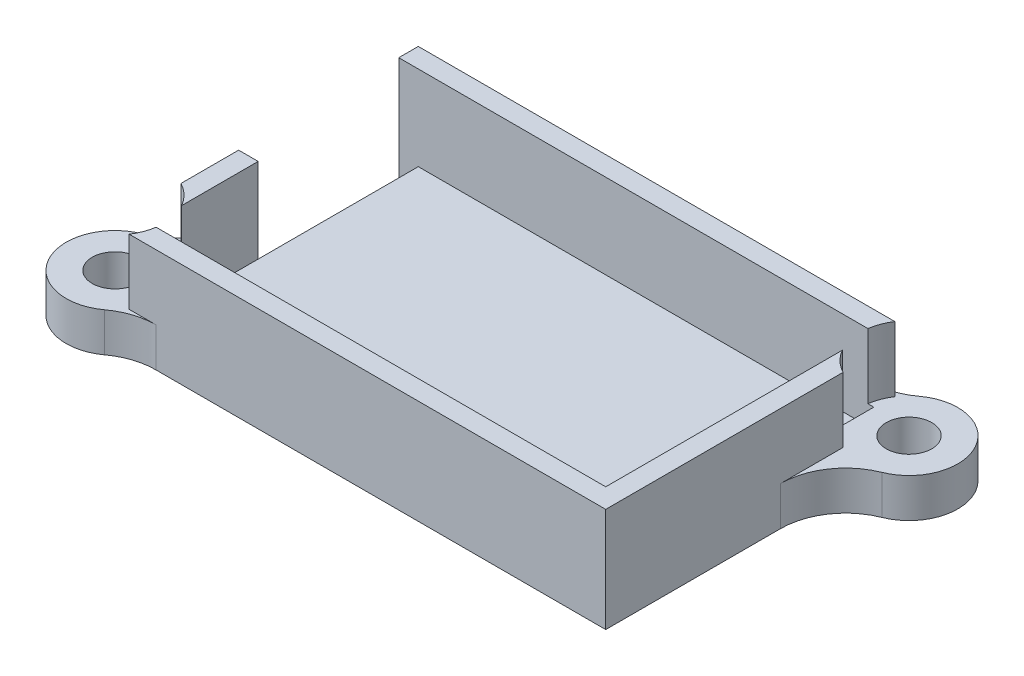
ISO-10303-21;
HEADER;
FILE_DESCRIPTION(('STEP AP214'),'2;1');
FILE_NAME('part.step','',(''),(''),'','','');
FILE_SCHEMA(('AUTOMOTIVE_DESIGN { 1 0 10303 214 1 1 1 1 }'));
ENDSEC;
DATA;
#1=APPLICATION_CONTEXT('core data for automotive mechanical design processes');
#2=APPLICATION_PROTOCOL_DEFINITION('international standard','automotive_design',2000,#1);
#3=PRODUCT_CONTEXT('',#1,'mechanical');
#4=PRODUCT('Part','Part','',(#3));
#5=PRODUCT_RELATED_PRODUCT_CATEGORY('part','',(#4));
#6=PRODUCT_DEFINITION_FORMATION('','',#4);
#7=PRODUCT_DEFINITION_CONTEXT('part definition',#1,'design');
#8=PRODUCT_DEFINITION('design','',#6,#7);
#9=PRODUCT_DEFINITION_SHAPE('','',#8);
#10=(LENGTH_UNIT() NAMED_UNIT(*) SI_UNIT(.MILLI.,.METRE.));
#11=(NAMED_UNIT(*) PLANE_ANGLE_UNIT() SI_UNIT($,.RADIAN.));
#12=(NAMED_UNIT(*) SI_UNIT($,.STERADIAN.) SOLID_ANGLE_UNIT());
#13=UNCERTAINTY_MEASURE_WITH_UNIT(LENGTH_MEASURE(1.E-05),#10,'distance_accuracy_value','');
#14=(GEOMETRIC_REPRESENTATION_CONTEXT(3) GLOBAL_UNCERTAINTY_ASSIGNED_CONTEXT((#13)) GLOBAL_UNIT_ASSIGNED_CONTEXT((#10,
#11,#12)) REPRESENTATION_CONTEXT('',''));
#15=CARTESIAN_POINT('',(0.,0.,0.));
#16=DIRECTION('',(0.,0.,1.));
#17=DIRECTION('',(1.,0.,0.));
#18=AXIS2_PLACEMENT_3D('',#15,#16,#17);
#19=CARTESIAN_POINT('',(-20.75,8.,9.75000000000024));
#20=DIRECTION('',(0.,-1.,0.));
#21=DIRECTION('',(0.,0.,-1.));
#22=AXIS2_PLACEMENT_3D('',#19,#20,#21);
#23=CYLINDRICAL_SURFACE('',#22,3.75);
#24=CARTESIAN_POINT('',(-20.75,3.,9.75000000000024));
#25=DIRECTION('',(0.,1.,0.));
#26=DIRECTION('',(0.,0.,1.));
#27=AXIS2_PLACEMENT_3D('',#24,#25,#26);
#28=CIRCLE('',#27,3.75);
#29=CARTESIAN_POINT('',(-22.1366660575432,3.,6.2657989086656));
#30=VERTEX_POINT('',#29);
#31=CARTESIAN_POINT('',(-18.5288585394541,3.,12.7714285714287));
#32=VERTEX_POINT('',#31);
#33=EDGE_CURVE('E376',#30,#32,#28,.T.);
#34=ORIENTED_EDGE('',*,*,#33,.F.);
#35=DIRECTION('',(0.,-1.,0.));
#36=VECTOR('',#35,1.);
#37=CARTESIAN_POINT('',(-22.1366660575432,8.,6.2657989086656));
#38=LINE('',#37,#36);
#39=CARTESIAN_POINT('',(-22.1366660575432,0.,6.2657989086656));
#40=VERTEX_POINT('',#39);
#41=EDGE_CURVE('E340',#30,#40,#38,.T.);
#42=ORIENTED_EDGE('',*,*,#41,.T.);
#43=CARTESIAN_POINT('',(-20.75,0.,9.75000000000024));
#44=DIRECTION('',(0.,1.,0.));
#45=DIRECTION('',(0.,0.,1.));
#46=AXIS2_PLACEMENT_3D('',#43,#44,#45);
#47=CIRCLE('',#46,3.75);
#48=CARTESIAN_POINT('',(-18.5288585394541,0.,12.7714285714287));
#49=VERTEX_POINT('',#48);
#50=EDGE_CURVE('E218',#40,#49,#47,.T.);
#51=ORIENTED_EDGE('',*,*,#50,.T.);
#52=DIRECTION('',(0.,-1.,0.));
#53=VECTOR('',#52,1.);
#54=CARTESIAN_POINT('',(-18.5288585394541,8.,12.7714285714287));
#55=LINE('',#54,#53);
#56=EDGE_CURVE('E338',#49,#32,#55,.F.);
#57=ORIENTED_EDGE('',*,*,#56,.T.);
#58=EDGE_LOOP('',(#34,#42,#51,#57));
#59=FACE_BOUND('',#58,.T.);
#60=ADVANCED_FACE('F41',(#59),#23,.T.);
#61=CARTESIAN_POINT('',(20.75,8.,-9.74999999999976));
#62=DIRECTION('',(0.,-1.,0.));
#63=DIRECTION('',(0.,0.,-1.));
#64=AXIS2_PLACEMENT_3D('',#61,#62,#63);
#65=CYLINDRICAL_SURFACE('',#64,3.75);
#66=CARTESIAN_POINT('',(20.75,0.,-9.74999999999976));
#67=DIRECTION('',(0.,1.,0.));
#68=DIRECTION('',(0.,0.,1.));
#69=AXIS2_PLACEMENT_3D('',#66,#67,#68);
#70=CIRCLE('',#69,3.75);
#71=CARTESIAN_POINT('',(22.1428571428572,0.,-6.26826925515577));
#72=VERTEX_POINT('',#71);
#73=CARTESIAN_POINT('',(18.5288585394545,0.,-12.7714285714284));
#74=VERTEX_POINT('',#73);
#75=EDGE_CURVE('E252',#72,#74,#70,.T.);
#76=ORIENTED_EDGE('',*,*,#75,.T.);
#77=DIRECTION('',(0.,-1.,0.));
#78=VECTOR('',#77,1.);
#79=CARTESIAN_POINT('',(18.5288585394545,8.,-12.7714285714284));
#80=LINE('',#79,#78);
#81=CARTESIAN_POINT('',(18.5288585394545,3.,-12.7714285714284));
#82=VERTEX_POINT('',#81);
#83=EDGE_CURVE('E331',#74,#82,#80,.F.);
#84=ORIENTED_EDGE('',*,*,#83,.T.);
#85=CARTESIAN_POINT('',(20.75,3.,-9.74999999999976));
#86=DIRECTION('',(0.,1.,0.));
#87=DIRECTION('',(0.,0.,1.));
#88=AXIS2_PLACEMENT_3D('',#85,#86,#87);
#89=CIRCLE('',#88,3.75);
#90=CARTESIAN_POINT('',(22.1428571428572,3.,-6.26826925515577));
#91=VERTEX_POINT('',#90);
#92=EDGE_CURVE('E414',#91,#82,#89,.T.);
#93=ORIENTED_EDGE('',*,*,#92,.F.);
#94=DIRECTION('',(0.,-1.,0.));
#95=VECTOR('',#94,1.);
#96=CARTESIAN_POINT('',(22.1428571428572,8.,-6.26826925515577));
#97=LINE('',#96,#95);
#98=EDGE_CURVE('E328',#91,#72,#97,.T.);
#99=ORIENTED_EDGE('',*,*,#98,.T.);
#100=EDGE_LOOP('',(#76,#84,#93,#99));
#101=FACE_BOUND('',#100,.T.);
#102=ADVANCED_FACE('F490',(#101),#65,.T.);
#103=CARTESIAN_POINT('',(0.,8.,-10.3));
#104=DIRECTION('',(0.,0.,-1.));
#105=DIRECTION('',(-1.,0.,0.));
#106=AXIS2_PLACEMENT_3D('',#103,#104,#105);
#107=PLANE('',#106);
#108=DIRECTION('',(0.,-1.,0.));
#109=VECTOR('',#108,1.);
#110=CARTESIAN_POINT('',(17.0405526018018,8.,-10.3));
#111=LINE('',#110,#109);
#112=CARTESIAN_POINT('',(17.0405526018018,8.,-10.3));
#113=VERTEX_POINT('',#112);
#114=CARTESIAN_POINT('',(17.0405526018018,3.,-10.3));
#115=VERTEX_POINT('',#114);
#116=EDGE_CURVE('E402',#113,#115,#111,.T.);
#117=ORIENTED_EDGE('',*,*,#116,.F.);
#118=DIRECTION('',(1.,0.,0.));
#119=VECTOR('',#118,1.);
#120=CARTESIAN_POINT('',(0.,8.,-10.3));
#121=LINE('',#120,#119);
#122=CARTESIAN_POINT('',(-19.,8.,-10.3));
#123=VERTEX_POINT('',#122);
#124=EDGE_CURVE('E430',#123,#113,#121,.T.);
#125=ORIENTED_EDGE('',*,*,#124,.F.);
#126=DIRECTION('',(0.,-1.,0.));
#127=VECTOR('',#126,1.);
#128=CARTESIAN_POINT('',(-19.,8.,-10.3));
#129=LINE('',#128,#127);
#130=CARTESIAN_POINT('',(-19.,0.,-10.3));
#131=VERTEX_POINT('',#130);
#132=EDGE_CURVE('E286',#123,#131,#129,.T.);
#133=ORIENTED_EDGE('',*,*,#132,.T.);
#134=DIRECTION('',(1.,0.,0.));
#135=VECTOR('',#134,1.);
#136=CARTESIAN_POINT('',(0.,0.,-10.3));
#137=LINE('',#136,#135);
#138=CARTESIAN_POINT('',(-17.5,0.,-10.3));
#139=VERTEX_POINT('',#138);
#140=EDGE_CURVE('E261',#131,#139,#137,.T.);
#141=ORIENTED_EDGE('',*,*,#140,.T.);
#142=DIRECTION('',(0.,-1.,0.));
#143=VECTOR('',#142,1.);
#144=CARTESIAN_POINT('',(-17.5,1.5,-10.3));
#145=LINE('',#144,#143);
#146=CARTESIAN_POINT('',(-17.5,1.5,-10.3));
#147=VERTEX_POINT('',#146);
#148=EDGE_CURVE('E313',#147,#139,#145,.T.);
#149=ORIENTED_EDGE('',*,*,#148,.F.);
#150=DIRECTION('',(1.,0.,0.));
#151=VECTOR('',#150,1.);
#152=CARTESIAN_POINT('',(0.,1.5,-10.3));
#153=LINE('',#152,#151);
#154=CARTESIAN_POINT('',(17.5,1.5,-10.3));
#155=VERTEX_POINT('',#154);
#156=EDGE_CURVE('E310',#147,#155,#153,.T.);
#157=ORIENTED_EDGE('',*,*,#156,.T.);
#158=DIRECTION('',(0.,-1.,0.));
#159=VECTOR('',#158,1.);
#160=CARTESIAN_POINT('',(17.5,8.,-10.3));
#161=LINE('',#160,#159);
#162=CARTESIAN_POINT('',(17.5,3.,-10.3));
#163=VERTEX_POINT('',#162);
#164=EDGE_CURVE('E284',#163,#155,#161,.T.);
#165=ORIENTED_EDGE('',*,*,#164,.F.);
#166=DIRECTION('',(1.,0.,0.));
#167=VECTOR('',#166,1.);
#168=CARTESIAN_POINT('',(0.,3.,-10.3));
#169=LINE('',#168,#167);
#170=EDGE_CURVE('E403',#115,#163,#169,.T.);
#171=ORIENTED_EDGE('',*,*,#170,.F.);
#172=EDGE_LOOP('',(#117,#125,#133,#141,#149,#157,#165,#171));
#173=FACE_BOUND('',#172,.T.);
#174=ADVANCED_FACE('F451',(#173),#107,.F.);
#175=CARTESIAN_POINT('',(17.5,8.,0.));
#176=DIRECTION('',(-1.,0.,0.));
#177=DIRECTION('',(0.,0.,1.));
#178=AXIS2_PLACEMENT_3D('',#175,#176,#177);
#179=PLANE('',#178);
#180=DIRECTION('',(0.,0.,-1.));
#181=VECTOR('',#180,1.);
#182=CARTESIAN_POINT('',(17.5,8.,0.));
#183=LINE('',#182,#181);
#184=CARTESIAN_POINT('',(17.5,8.,10.3));
#185=VERTEX_POINT('',#184);
#186=CARTESIAN_POINT('',(17.5,8.,-7.87917130661283));
#187=VERTEX_POINT('',#186);
#188=EDGE_CURVE('E239',#185,#187,#183,.T.);
#189=ORIENTED_EDGE('',*,*,#188,.T.);
#190=DIRECTION('',(0.,-1.,0.));
#191=VECTOR('',#190,1.);
#192=CARTESIAN_POINT('',(17.5,8.,-7.87917130661283));
#193=LINE('',#192,#191);
#194=CARTESIAN_POINT('',(17.5,3.,-7.87917130661283));
#195=VERTEX_POINT('',#194);
#196=EDGE_CURVE('E390',#187,#195,#193,.T.);
#197=ORIENTED_EDGE('',*,*,#196,.T.);
#198=DIRECTION('',(0.,0.,-1.));
#199=VECTOR('',#198,1.);
#200=CARTESIAN_POINT('',(17.5,3.,0.));
#201=LINE('',#200,#199);
#202=EDGE_CURVE('E407',#195,#163,#201,.T.);
#203=ORIENTED_EDGE('',*,*,#202,.T.);
#204=ORIENTED_EDGE('',*,*,#164,.T.);
#205=DIRECTION('',(0.,0.,-1.));
#206=VECTOR('',#205,1.);
#207=CARTESIAN_POINT('',(17.5,1.5,0.));
#208=LINE('',#207,#206);
#209=CARTESIAN_POINT('',(17.5,1.5,10.3));
#210=VERTEX_POINT('',#209);
#211=EDGE_CURVE('E307',#210,#155,#208,.T.);
#212=ORIENTED_EDGE('',*,*,#211,.F.);
#213=DIRECTION('',(0.,-1.,0.));
#214=VECTOR('',#213,1.);
#215=CARTESIAN_POINT('',(17.5,8.,10.3));
#216=LINE('',#215,#214);
#217=EDGE_CURVE('E281',#185,#210,#216,.T.);
#218=ORIENTED_EDGE('',*,*,#217,.F.);
#219=EDGE_LOOP('',(#189,#197,#203,#204,#212,#218));
#220=FACE_BOUND('',#219,.T.);
#221=ADVANCED_FACE('F436',(#220),#179,.T.);
#222=CARTESIAN_POINT('',(0.,8.,10.3));
#223=DIRECTION('',(0.,0.,-1.));
#224=DIRECTION('',(-1.,0.,0.));
#225=AXIS2_PLACEMENT_3D('',#222,#223,#224);
#226=PLANE('',#225);
#227=DIRECTION('',(1.,0.,0.));
#228=VECTOR('',#227,1.);
#229=CARTESIAN_POINT('',(0.,3.,10.3));
#230=LINE('',#229,#228);
#231=CARTESIAN_POINT('',(-17.5,3.,10.3));
#232=VERTEX_POINT('',#231);
#233=CARTESIAN_POINT('',(-17.0405526018017,3.,10.3));
#234=VERTEX_POINT('',#233);
#235=EDGE_CURVE('E393',#232,#234,#230,.T.);
#236=ORIENTED_EDGE('',*,*,#235,.T.);
#237=DIRECTION('',(0.,-1.,0.));
#238=VECTOR('',#237,1.);
#239=CARTESIAN_POINT('',(-17.0405526018017,8.,10.3));
#240=LINE('',#239,#238);
#241=CARTESIAN_POINT('',(-17.0405526018017,8.,10.3));
#242=VERTEX_POINT('',#241);
#243=EDGE_CURVE('E219',#242,#234,#240,.T.);
#244=ORIENTED_EDGE('',*,*,#243,.F.);
#245=DIRECTION('',(1.,0.,0.));
#246=VECTOR('',#245,1.);
#247=CARTESIAN_POINT('',(0.,8.,10.3));
#248=LINE('',#247,#246);
#249=EDGE_CURVE('E236',#242,#185,#248,.T.);
#250=ORIENTED_EDGE('',*,*,#249,.T.);
#251=ORIENTED_EDGE('',*,*,#217,.T.);
#252=DIRECTION('',(1.,0.,0.));
#253=VECTOR('',#252,1.);
#254=CARTESIAN_POINT('',(0.,1.5,10.3));
#255=LINE('',#254,#253);
#256=CARTESIAN_POINT('',(-17.5,1.5,10.3));
#257=VERTEX_POINT('',#256);
#258=EDGE_CURVE('E303',#257,#210,#255,.T.);
#259=ORIENTED_EDGE('',*,*,#258,.F.);
#260=DIRECTION('',(0.,-1.,0.));
#261=VECTOR('',#260,1.);
#262=CARTESIAN_POINT('',(-17.5,8.,10.3));
#263=LINE('',#262,#261);
#264=EDGE_CURVE('E279',#232,#257,#263,.T.);
#265=ORIENTED_EDGE('',*,*,#264,.F.);
#266=EDGE_LOOP('',(#236,#244,#250,#251,#259,#265));
#267=FACE_BOUND('',#266,.T.);
#268=ADVANCED_FACE('F459',(#267),#226,.T.);
#269=CARTESIAN_POINT('',(-17.5,8.,0.));
#270=DIRECTION('',(-1.,0.,0.));
#271=DIRECTION('',(0.,0.,1.));
#272=AXIS2_PLACEMENT_3D('',#269,#270,#271);
#273=PLANE('',#272);
#274=DIRECTION('',(0.,-1.,0.));
#275=VECTOR('',#274,1.);
#276=CARTESIAN_POINT('',(-17.5,8.,7.87917130661325));
#277=LINE('',#276,#275);
#278=CARTESIAN_POINT('',(-17.5,8.,7.87917130661325));
#279=VERTEX_POINT('',#278);
#280=CARTESIAN_POINT('',(-17.5,3.,7.87917130661325));
#281=VERTEX_POINT('',#280);
#282=EDGE_CURVE('E206',#279,#281,#277,.T.);
#283=ORIENTED_EDGE('',*,*,#282,.T.);
#284=DIRECTION('',(0.,0.,-1.));
#285=VECTOR('',#284,1.);
#286=CARTESIAN_POINT('',(-17.5,3.,0.));
#287=LINE('',#286,#285);
#288=EDGE_CURVE('E388',#232,#281,#287,.T.);
#289=ORIENTED_EDGE('',*,*,#288,.F.);
#290=ORIENTED_EDGE('',*,*,#264,.T.);
#291=DIRECTION('',(0.,0.,-1.));
#292=VECTOR('',#291,1.);
#293=CARTESIAN_POINT('',(-17.5,1.5,0.));
#294=LINE('',#293,#292);
#295=CARTESIAN_POINT('',(-17.5,1.5,2.));
#296=VERTEX_POINT('',#295);
#297=EDGE_CURVE('E301',#257,#296,#294,.T.);
#298=ORIENTED_EDGE('',*,*,#297,.T.);
#299=DIRECTION('',(0.,-1.,0.));
#300=VECTOR('',#299,1.);
#301=CARTESIAN_POINT('',(-17.5,8.,2.));
#302=LINE('',#301,#300);
#303=CARTESIAN_POINT('',(-17.5,8.,2.));
#304=VERTEX_POINT('',#303);
#305=EDGE_CURVE('E233',#304,#296,#302,.T.);
#306=ORIENTED_EDGE('',*,*,#305,.F.);
#307=DIRECTION('',(0.,0.,-1.));
#308=VECTOR('',#307,1.);
#309=CARTESIAN_POINT('',(-17.5,8.,0.));
#310=LINE('',#309,#308);
#311=EDGE_CURVE('E225',#279,#304,#310,.T.);
#312=ORIENTED_EDGE('',*,*,#311,.F.);
#313=EDGE_LOOP('',(#283,#289,#290,#298,#306,#312));
#314=FACE_BOUND('',#313,.T.);
#315=ADVANCED_FACE('F231',(#314),#273,.F.);
#316=CARTESIAN_POINT('',(-20.75,8.,9.75000000000024));
#317=DIRECTION('',(0.,-1.,0.));
#318=DIRECTION('',(0.,0.,-1.));
#319=AXIS2_PLACEMENT_3D('',#316,#317,#318);
#320=CYLINDRICAL_SURFACE('',#319,1.75);
#321=CARTESIAN_POINT('',(-20.75,0.,9.75000000000024));
#322=DIRECTION('',(0.,1.,0.));
#323=DIRECTION('',(0.,0.,1.));
#324=AXIS2_PLACEMENT_3D('',#321,#322,#323);
#325=CIRCLE('',#324,1.75);
#326=CARTESIAN_POINT('',(-20.75,0.,11.5000000000002));
#327=VERTEX_POINT('',#326);
#328=EDGE_CURVE('E265',#327,#327,#325,.T.);
#329=ORIENTED_EDGE('',*,*,#328,.F.);
#330=EDGE_LOOP('',(#329));
#331=FACE_BOUND('',#330,.T.);
#332=CARTESIAN_POINT('',(-20.75,3.,9.75000000000024));
#333=DIRECTION('',(0.,1.,0.));
#334=DIRECTION('',(0.,0.,1.));
#335=AXIS2_PLACEMENT_3D('',#332,#333,#334);
#336=CIRCLE('',#335,1.75);
#337=CARTESIAN_POINT('',(-20.75,3.,11.5000000000002));
#338=VERTEX_POINT('',#337);
#339=EDGE_CURVE('E229',#338,#338,#336,.T.);
#340=ORIENTED_EDGE('',*,*,#339,.T.);
#341=EDGE_LOOP('',(#340));
#342=FACE_BOUND('',#341,.T.);
#343=ADVANCED_FACE('F590',(#331,#342),#320,.F.);
#344=CARTESIAN_POINT('',(20.75,8.,-9.74999999999976));
#345=DIRECTION('',(0.,-1.,0.));
#346=DIRECTION('',(0.,0.,-1.));
#347=AXIS2_PLACEMENT_3D('',#344,#345,#346);
#348=CYLINDRICAL_SURFACE('',#347,1.75);
#349=CARTESIAN_POINT('',(20.75,0.,-9.74999999999976));
#350=DIRECTION('',(0.,1.,0.));
#351=DIRECTION('',(0.,0.,1.));
#352=AXIS2_PLACEMENT_3D('',#349,#350,#351);
#353=CIRCLE('',#352,1.75);
#354=CARTESIAN_POINT('',(20.75,0.,-7.99999999999976));
#355=VERTEX_POINT('',#354);
#356=EDGE_CURVE('E268',#355,#355,#353,.T.);
#357=ORIENTED_EDGE('',*,*,#356,.F.);
#358=EDGE_LOOP('',(#357));
#359=FACE_BOUND('',#358,.T.);
#360=CARTESIAN_POINT('',(20.75,3.,-9.74999999999976));
#361=DIRECTION('',(0.,1.,0.));
#362=DIRECTION('',(0.,0.,1.));
#363=AXIS2_PLACEMENT_3D('',#360,#361,#362);
#364=CIRCLE('',#363,1.75);
#365=CARTESIAN_POINT('',(20.75,3.,-7.99999999999976));
#366=VERTEX_POINT('',#365);
#367=EDGE_CURVE('E404',#366,#366,#364,.T.);
#368=ORIENTED_EDGE('',*,*,#367,.T.);
#369=EDGE_LOOP('',(#368));
#370=FACE_BOUND('',#369,.T.);
#371=ADVANCED_FACE('F588',(#359,#370),#348,.F.);
#372=CARTESIAN_POINT('',(0.,8.,0.));
#373=DIRECTION('',(0.,1.,0.));
#374=DIRECTION('',(0.,0.,1.));
#375=AXIS2_PLACEMENT_3D('',#372,#373,#374);
#376=PLANE('',#375);
#377=DIRECTION('',(0.,0.,-1.));
#378=VECTOR('',#377,1.);
#379=CARTESIAN_POINT('',(-19.,8.,0.));
#380=LINE('',#379,#378);
#381=CARTESIAN_POINT('',(-19.,8.,6.43337520964483));
#382=VERTEX_POINT('',#381);
#383=CARTESIAN_POINT('',(-19.,8.,2.));
#384=VERTEX_POINT('',#383);
#385=EDGE_CURVE('E228',#382,#384,#380,.T.);
#386=ORIENTED_EDGE('',*,*,#385,.F.);
#387=CARTESIAN_POINT('',(-20.75,8.,9.75000000000024));
#388=DIRECTION('',(0.,1.,0.));
#389=DIRECTION('',(0.,0.,1.));
#390=AXIS2_PLACEMENT_3D('',#387,#388,#389);
#391=CIRCLE('',#390,3.75);
#392=EDGE_CURVE('E210',#279,#382,#391,.T.);
#393=ORIENTED_EDGE('',*,*,#392,.F.);
#394=ORIENTED_EDGE('',*,*,#311,.T.);
#395=DIRECTION('',(1.,0.,0.));
#396=VECTOR('',#395,1.);
#397=CARTESIAN_POINT('',(0.,8.,2.));
#398=LINE('',#397,#396);
#399=EDGE_CURVE('E235',#384,#304,#398,.T.);
#400=ORIENTED_EDGE('',*,*,#399,.F.);
#401=EDGE_LOOP('',(#386,#393,#394,#400));
#402=FACE_BOUND('',#401,.T.);
#403=ADVANCED_FACE('F223',(#402),#376,.T.);
#404=ORIENTED_EDGE('',*,*,#249,.F.);
#405=CARTESIAN_POINT('',(-20.75,8.,9.75000000000024));
#406=DIRECTION('',(0.,1.,0.));
#407=DIRECTION('',(0.,0.,1.));
#408=AXIS2_PLACEMENT_3D('',#405,#406,#407);
#409=CIRCLE('',#408,3.75);
#410=CARTESIAN_POINT('',(-17.6099363063783,8.,11.8));
#411=VERTEX_POINT('',#410);
#412=EDGE_CURVE('E321',#242,#411,#409,.F.);
#413=ORIENTED_EDGE('',*,*,#412,.T.);
#414=DIRECTION('',(1.,0.,0.));
#415=VECTOR('',#414,1.);
#416=CARTESIAN_POINT('',(0.,8.,11.8));
#417=LINE('',#416,#415);
#418=CARTESIAN_POINT('',(19.,8.,11.8));
#419=VERTEX_POINT('',#418);
#420=EDGE_CURVE('E271',#411,#419,#417,.T.);
#421=ORIENTED_EDGE('',*,*,#420,.T.);
#422=DIRECTION('',(0.,0.,-1.));
#423=VECTOR('',#422,1.);
#424=CARTESIAN_POINT('',(19.,8.,0.));
#425=LINE('',#424,#423);
#426=CARTESIAN_POINT('',(19.,8.,-6.43337520964437));
#427=VERTEX_POINT('',#426);
#428=EDGE_CURVE('E421',#419,#427,#425,.T.);
#429=ORIENTED_EDGE('',*,*,#428,.T.);
#430=CARTESIAN_POINT('',(20.75,8.,-9.74999999999976));
#431=DIRECTION('',(0.,1.,0.));
#432=DIRECTION('',(0.,0.,1.));
#433=AXIS2_PLACEMENT_3D('',#430,#431,#432);
#434=CIRCLE('',#433,3.75);
#435=EDGE_CURVE('E400',#187,#427,#434,.T.);
#436=ORIENTED_EDGE('',*,*,#435,.F.);
#437=ORIENTED_EDGE('',*,*,#188,.F.);
#438=EDGE_LOOP('',(#404,#413,#421,#429,#436,#437));
#439=FACE_BOUND('',#438,.T.);
#440=ADVANCED_FACE('F440',(#439),#376,.T.);
#441=ORIENTED_EDGE('',*,*,#124,.T.);
#442=CARTESIAN_POINT('',(20.75,8.,-9.74999999999976));
#443=DIRECTION('',(0.,1.,0.));
#444=DIRECTION('',(0.,0.,1.));
#445=AXIS2_PLACEMENT_3D('',#442,#443,#444);
#446=CIRCLE('',#445,3.75);
#447=CARTESIAN_POINT('',(17.6099363063787,8.,-11.8));
#448=VERTEX_POINT('',#447);
#449=EDGE_CURVE('E318',#113,#448,#446,.F.);
#450=ORIENTED_EDGE('',*,*,#449,.T.);
#451=DIRECTION('',(1.,0.,0.));
#452=VECTOR('',#451,1.);
#453=CARTESIAN_POINT('',(0.,8.,-11.8));
#454=LINE('',#453,#452);
#455=CARTESIAN_POINT('',(-19.,8.,-11.8));
#456=VERTEX_POINT('',#455);
#457=EDGE_CURVE('E424',#456,#448,#454,.T.);
#458=ORIENTED_EDGE('',*,*,#457,.F.);
#459=DIRECTION('',(0.,0.,-1.));
#460=VECTOR('',#459,1.);
#461=CARTESIAN_POINT('',(-19.,8.,0.));
#462=LINE('',#461,#460);
#463=EDGE_CURVE('E427',#123,#456,#462,.T.);
#464=ORIENTED_EDGE('',*,*,#463,.F.);
#465=EDGE_LOOP('',(#441,#450,#458,#464));
#466=FACE_BOUND('',#465,.T.);
#467=ADVANCED_FACE('F507',(#466),#376,.T.);
#468=CARTESIAN_POINT('',(-17.5,1.5,0.));
#469=DIRECTION('',(-1.,0.,0.));
#470=DIRECTION('',(0.,0.,1.));
#471=AXIS2_PLACEMENT_3D('',#468,#469,#470);
#472=PLANE('',#471);
#473=CARTESIAN_POINT('',(-17.5,0.,2.));
#474=VERTEX_POINT('',#473);
#475=EDGE_CURVE('E277',#296,#474,#302,.T.);
#476=ORIENTED_EDGE('',*,*,#475,.F.);
#477=EDGE_CURVE('E304',#296,#147,#294,.T.);
#478=ORIENTED_EDGE('',*,*,#477,.T.);
#479=ORIENTED_EDGE('',*,*,#148,.T.);
#480=DIRECTION('',(0.,0.,-1.));
#481=VECTOR('',#480,1.);
#482=CARTESIAN_POINT('',(-17.5,0.,0.));
#483=LINE('',#482,#481);
#484=EDGE_CURVE('E300',#474,#139,#483,.T.);
#485=ORIENTED_EDGE('',*,*,#484,.F.);
#486=EDGE_LOOP('',(#476,#478,#479,#485));
#487=FACE_BOUND('',#486,.T.);
#488=ADVANCED_FACE('F467',(#487),#472,.T.);
#489=CARTESIAN_POINT('',(0.,1.5,0.));
#490=DIRECTION('',(0.,1.,0.));
#491=DIRECTION('',(0.,0.,1.));
#492=AXIS2_PLACEMENT_3D('',#489,#490,#491);
#493=PLANE('',#492);
#494=ORIENTED_EDGE('',*,*,#297,.F.);
#495=ORIENTED_EDGE('',*,*,#258,.T.);
#496=ORIENTED_EDGE('',*,*,#211,.T.);
#497=ORIENTED_EDGE('',*,*,#156,.F.);
#498=ORIENTED_EDGE('',*,*,#477,.F.);
#499=EDGE_LOOP('',(#494,#495,#496,#497,#498));
#500=FACE_BOUND('',#499,.T.);
#501=ADVANCED_FACE('F457',(#500),#493,.T.);
#502=CARTESIAN_POINT('',(0.,0.,0.));
#503=DIRECTION('',(0.,1.,0.));
#504=DIRECTION('',(0.,0.,1.));
#505=AXIS2_PLACEMENT_3D('',#502,#503,#504);
#506=PLANE('',#505);
#507=ORIENTED_EDGE('',*,*,#484,.T.);
#508=ORIENTED_EDGE('',*,*,#140,.F.);
#509=DIRECTION('',(0.,0.,-1.));
#510=VECTOR('',#509,1.);
#511=CARTESIAN_POINT('',(-19.,0.,0.));
#512=LINE('',#511,#510);
#513=CARTESIAN_POINT('',(-19.,0.,-11.8));
#514=VERTEX_POINT('',#513);
#515=EDGE_CURVE('E258',#131,#514,#512,.T.);
#516=ORIENTED_EDGE('',*,*,#515,.T.);
#517=DIRECTION('',(1.,0.,0.));
#518=VECTOR('',#517,1.);
#519=CARTESIAN_POINT('',(0.,0.,-11.8));
#520=LINE('',#519,#518);
#521=CARTESIAN_POINT('',(15.5673365920604,0.,-11.8));
#522=VERTEX_POINT('',#521);
#523=EDGE_CURVE('E255',#514,#522,#520,.T.);
#524=ORIENTED_EDGE('',*,*,#523,.T.);
#525=CARTESIAN_POINT('',(15.5673365920604,0.,-16.8));
#526=DIRECTION('',(0.,1.,0.));
#527=DIRECTION('',(0.,0.,1.));
#528=AXIS2_PLACEMENT_3D('',#525,#526,#527);
#529=CIRCLE('',#528,5.);
#530=EDGE_CURVE('E349',#522,#74,#529,.T.);
#531=ORIENTED_EDGE('',*,*,#530,.T.);
#532=ORIENTED_EDGE('',*,*,#75,.F.);
#533=CARTESIAN_POINT('',(24.,0.,-1.62596159536379));
#534=DIRECTION('',(0.,1.,0.));
#535=DIRECTION('',(0.,0.,1.));
#536=AXIS2_PLACEMENT_3D('',#533,#534,#535);
#537=CIRCLE('',#536,5.);
#538=CARTESIAN_POINT('',(19.,0.,-1.62596159536379));
#539=VERTEX_POINT('',#538);
#540=EDGE_CURVE('E353',#72,#539,#537,.T.);
#541=ORIENTED_EDGE('',*,*,#540,.T.);
#542=DIRECTION('',(0.,0.,-1.));
#543=VECTOR('',#542,1.);
#544=CARTESIAN_POINT('',(19.,0.,0.));
#545=LINE('',#544,#543);
#546=CARTESIAN_POINT('',(19.,0.,11.8));
#547=VERTEX_POINT('',#546);
#548=EDGE_CURVE('E249',#547,#539,#545,.T.);
#549=ORIENTED_EDGE('',*,*,#548,.F.);
#550=DIRECTION('',(1.,0.,0.));
#551=VECTOR('',#550,1.);
#552=CARTESIAN_POINT('',(0.,0.,11.8));
#553=LINE('',#552,#551);
#554=CARTESIAN_POINT('',(-15.5673365920597,0.,11.8));
#555=VERTEX_POINT('',#554);
#556=EDGE_CURVE('E247',#555,#547,#553,.T.);
#557=ORIENTED_EDGE('',*,*,#556,.F.);
#558=CARTESIAN_POINT('',(-15.5673365920597,0.,16.8));
#559=DIRECTION('',(0.,1.,0.));
#560=DIRECTION('',(0.,0.,1.));
#561=AXIS2_PLACEMENT_3D('',#558,#559,#560);
#562=CIRCLE('',#561,5.);
#563=EDGE_CURVE('E49',#555,#49,#562,.T.);
#564=ORIENTED_EDGE('',*,*,#563,.T.);
#565=ORIENTED_EDGE('',*,*,#50,.F.);
#566=CARTESIAN_POINT('',(-23.9855541342675,0.,1.62019745355275));
#567=DIRECTION('',(0.,1.,0.));
#568=DIRECTION('',(0.,0.,1.));
#569=AXIS2_PLACEMENT_3D('',#566,#567,#568);
#570=CIRCLE('',#569,5.);
#571=CARTESIAN_POINT('',(-19.,0.,2.));
#572=VERTEX_POINT('',#571);
#573=EDGE_CURVE('E357',#40,#572,#570,.T.);
#574=ORIENTED_EDGE('',*,*,#573,.T.);
#575=DIRECTION('',(1.,0.,0.));
#576=VECTOR('',#575,1.);
#577=CARTESIAN_POINT('',(0.,0.,2.));
#578=LINE('',#577,#576);
#579=EDGE_CURVE('E263',#572,#474,#578,.T.);
#580=ORIENTED_EDGE('',*,*,#579,.T.);
#581=EDGE_LOOP('',(#507,#508,#516,#524,#531,#532,#541,#549,#557,#564,#565,#574,#580));
#582=FACE_BOUND('',#581,.T.);
#583=ORIENTED_EDGE('',*,*,#328,.T.);
#584=EDGE_LOOP('',(#583));
#585=FACE_BOUND('',#584,.T.);
#586=ORIENTED_EDGE('',*,*,#356,.T.);
#587=EDGE_LOOP('',(#586));
#588=FACE_BOUND('',#587,.T.);
#589=ADVANCED_FACE('F363',(#582,#585,#588),#506,.F.);
#590=CARTESIAN_POINT('',(0.,8.,11.8));
#591=DIRECTION('',(0.,0.,-1.));
#592=DIRECTION('',(-1.,0.,0.));
#593=AXIS2_PLACEMENT_3D('',#590,#591,#592);
#594=PLANE('',#593);
#595=DIRECTION('',(1.,0.,0.));
#596=VECTOR('',#595,1.);
#597=CARTESIAN_POINT('',(0.,3.,11.8));
#598=LINE('',#597,#596);
#599=CARTESIAN_POINT('',(-17.6099363063783,3.,11.8));
#600=VERTEX_POINT('',#599);
#601=CARTESIAN_POINT('',(-15.5673365920597,3.,11.8));
#602=VERTEX_POINT('',#601);
#603=EDGE_CURVE('E55',#600,#602,#598,.T.);
#604=ORIENTED_EDGE('',*,*,#603,.T.);
#605=DIRECTION('',(0.,1.,0.));
#606=VECTOR('',#605,1.);
#607=CARTESIAN_POINT('',(-15.5673365920597,0.,11.8));
#608=LINE('',#607,#606);
#609=EDGE_CURVE('E346',#602,#555,#608,.F.);
#610=ORIENTED_EDGE('',*,*,#609,.T.);
#611=ORIENTED_EDGE('',*,*,#556,.T.);
#612=DIRECTION('',(0.,-1.,0.));
#613=VECTOR('',#612,1.);
#614=CARTESIAN_POINT('',(19.,8.,11.8));
#615=LINE('',#614,#613);
#616=EDGE_CURVE('E295',#419,#547,#615,.T.);
#617=ORIENTED_EDGE('',*,*,#616,.F.);
#618=ORIENTED_EDGE('',*,*,#420,.F.);
#619=DIRECTION('',(0.,-1.,0.));
#620=VECTOR('',#619,1.);
#621=CARTESIAN_POINT('',(-17.6099363063783,8.,11.8));
#622=LINE('',#621,#620);
#623=EDGE_CURVE('E298',#411,#600,#622,.T.);
#624=ORIENTED_EDGE('',*,*,#623,.T.);
#625=EDGE_LOOP('',(#604,#610,#611,#617,#618,#624));
#626=FACE_BOUND('',#625,.T.);
#627=ADVANCED_FACE('F378',(#626),#594,.F.);
#628=CARTESIAN_POINT('',(19.,8.,0.));
#629=DIRECTION('',(-1.,0.,0.));
#630=DIRECTION('',(0.,0.,1.));
#631=AXIS2_PLACEMENT_3D('',#628,#629,#630);
#632=PLANE('',#631);
#633=ORIENTED_EDGE('',*,*,#548,.T.);
#634=DIRECTION('',(0.,1.,0.));
#635=VECTOR('',#634,1.);
#636=CARTESIAN_POINT('',(19.,3.,-1.62596159536379));
#637=LINE('',#636,#635);
#638=CARTESIAN_POINT('',(19.,3.,-1.62596159536379));
#639=VERTEX_POINT('',#638);
#640=EDGE_CURVE('E335',#539,#639,#637,.T.);
#641=ORIENTED_EDGE('',*,*,#640,.T.);
#642=DIRECTION('',(0.,0.,-1.));
#643=VECTOR('',#642,1.);
#644=CARTESIAN_POINT('',(19.,3.,0.));
#645=LINE('',#644,#643);
#646=CARTESIAN_POINT('',(19.,3.,-6.43337520964437));
#647=VERTEX_POINT('',#646);
#648=EDGE_CURVE('E333',#639,#647,#645,.T.);
#649=ORIENTED_EDGE('',*,*,#648,.T.);
#650=DIRECTION('',(0.,-1.,0.));
#651=VECTOR('',#650,1.);
#652=CARTESIAN_POINT('',(19.,8.,-6.43337520964437));
#653=LINE('',#652,#651);
#654=EDGE_CURVE('E292',#427,#647,#653,.T.);
#655=ORIENTED_EDGE('',*,*,#654,.F.);
#656=ORIENTED_EDGE('',*,*,#428,.F.);
#657=ORIENTED_EDGE('',*,*,#616,.T.);
#658=EDGE_LOOP('',(#633,#641,#649,#655,#656,#657));
#659=FACE_BOUND('',#658,.T.);
#660=ADVANCED_FACE('F619',(#659),#632,.F.);
#661=CARTESIAN_POINT('',(0.,8.,-11.8));
#662=DIRECTION('',(0.,0.,-1.));
#663=DIRECTION('',(-1.,0.,0.));
#664=AXIS2_PLACEMENT_3D('',#661,#662,#663);
#665=PLANE('',#664);
#666=DIRECTION('',(-1.,0.,0.));
#667=VECTOR('',#666,1.);
#668=CARTESIAN_POINT('',(0.,3.,-11.8));
#669=LINE('',#668,#667);
#670=CARTESIAN_POINT('',(17.6099363063787,3.,-11.8));
#671=VERTEX_POINT('',#670);
#672=CARTESIAN_POINT('',(15.5673365920604,3.,-11.8));
#673=VERTEX_POINT('',#672);
#674=EDGE_CURVE('E63',#671,#673,#669,.T.);
#675=ORIENTED_EDGE('',*,*,#674,.T.);
#676=DIRECTION('',(0.,-1.,0.));
#677=VECTOR('',#676,1.);
#678=CARTESIAN_POINT('',(15.5673365920604,8.,-11.8));
#679=LINE('',#678,#677);
#680=EDGE_CURVE('E325',#673,#522,#679,.T.);
#681=ORIENTED_EDGE('',*,*,#680,.T.);
#682=ORIENTED_EDGE('',*,*,#523,.F.);
#683=DIRECTION('',(0.,-1.,0.));
#684=VECTOR('',#683,1.);
#685=CARTESIAN_POINT('',(-19.,8.,-11.8));
#686=LINE('',#685,#684);
#687=EDGE_CURVE('E288',#456,#514,#686,.T.);
#688=ORIENTED_EDGE('',*,*,#687,.F.);
#689=ORIENTED_EDGE('',*,*,#457,.T.);
#690=DIRECTION('',(0.,-1.,0.));
#691=VECTOR('',#690,1.);
#692=CARTESIAN_POINT('',(17.6099363063787,8.,-11.8));
#693=LINE('',#692,#691);
#694=EDGE_CURVE('E290',#448,#671,#693,.T.);
#695=ORIENTED_EDGE('',*,*,#694,.T.);
#696=EDGE_LOOP('',(#675,#681,#682,#688,#689,#695));
#697=FACE_BOUND('',#696,.T.);
#698=ADVANCED_FACE('F616',(#697),#665,.T.);
#699=CARTESIAN_POINT('',(-19.,8.,0.));
#700=DIRECTION('',(-1.,0.,0.));
#701=DIRECTION('',(0.,0.,1.));
#702=AXIS2_PLACEMENT_3D('',#699,#700,#701);
#703=PLANE('',#702);
#704=ORIENTED_EDGE('',*,*,#515,.F.);
#705=ORIENTED_EDGE('',*,*,#132,.F.);
#706=ORIENTED_EDGE('',*,*,#463,.T.);
#707=ORIENTED_EDGE('',*,*,#687,.T.);
#708=EDGE_LOOP('',(#704,#705,#706,#707));
#709=FACE_BOUND('',#708,.T.);
#710=ADVANCED_FACE('F486',(#709),#703,.T.);
#711=CARTESIAN_POINT('',(0.,8.,2.));
#712=DIRECTION('',(0.,0.,-1.));
#713=DIRECTION('',(-1.,0.,0.));
#714=AXIS2_PLACEMENT_3D('',#711,#712,#713);
#715=PLANE('',#714);
#716=ORIENTED_EDGE('',*,*,#579,.F.);
#717=DIRECTION('',(0.,-1.,0.));
#718=VECTOR('',#717,1.);
#719=CARTESIAN_POINT('',(-19.,8.,2.));
#720=LINE('',#719,#718);
#721=CARTESIAN_POINT('',(-19.,3.,2.));
#722=VERTEX_POINT('',#721);
#723=EDGE_CURVE('E273',#722,#572,#720,.T.);
#724=ORIENTED_EDGE('',*,*,#723,.F.);
#725=EDGE_CURVE('E274',#384,#722,#720,.T.);
#726=ORIENTED_EDGE('',*,*,#725,.F.);
#727=ORIENTED_EDGE('',*,*,#399,.T.);
#728=ORIENTED_EDGE('',*,*,#305,.T.);
#729=ORIENTED_EDGE('',*,*,#475,.T.);
#730=EDGE_LOOP('',(#716,#724,#726,#727,#728,#729));
#731=FACE_BOUND('',#730,.T.);
#732=ADVANCED_FACE('F464',(#731),#715,.T.);
#733=CARTESIAN_POINT('',(-19.,8.,0.));
#734=DIRECTION('',(-1.,0.,0.));
#735=DIRECTION('',(0.,0.,1.));
#736=AXIS2_PLACEMENT_3D('',#733,#734,#735);
#737=PLANE('',#736);
#738=ORIENTED_EDGE('',*,*,#725,.T.);
#739=DIRECTION('',(0.,0.,1.));
#740=VECTOR('',#739,1.);
#741=CARTESIAN_POINT('',(-19.,3.,0.));
#742=LINE('',#741,#740);
#743=CARTESIAN_POINT('',(-19.,3.,6.43337520964483));
#744=VERTEX_POINT('',#743);
#745=EDGE_CURVE('E343',#722,#744,#742,.T.);
#746=ORIENTED_EDGE('',*,*,#745,.T.);
#747=DIRECTION('',(0.,-1.,0.));
#748=VECTOR('',#747,1.);
#749=CARTESIAN_POINT('',(-19.,8.,6.43337520964483));
#750=LINE('',#749,#748);
#751=EDGE_CURVE('E244',#382,#744,#750,.T.);
#752=ORIENTED_EDGE('',*,*,#751,.F.);
#753=ORIENTED_EDGE('',*,*,#385,.T.);
#754=EDGE_LOOP('',(#738,#746,#752,#753));
#755=FACE_BOUND('',#754,.T.);
#756=ADVANCED_FACE('F476',(#755),#737,.T.);
#757=CARTESIAN_POINT('',(20.75,8.,-9.74999999999976));
#758=DIRECTION('',(0.,-1.,0.));
#759=DIRECTION('',(0.,0.,-1.));
#760=AXIS2_PLACEMENT_3D('',#757,#758,#759);
#761=CYLINDRICAL_SURFACE('',#760,3.75);
#762=ORIENTED_EDGE('',*,*,#654,.T.);
#763=EDGE_CURVE('E411',#195,#647,#89,.T.);
#764=ORIENTED_EDGE('',*,*,#763,.F.);
#765=ORIENTED_EDGE('',*,*,#196,.F.);
#766=ORIENTED_EDGE('',*,*,#435,.T.);
#767=EDGE_LOOP('',(#762,#764,#765,#766));
#768=FACE_BOUND('',#767,.T.);
#769=ADVANCED_FACE('F444',(#768),#761,.F.);
#770=ORIENTED_EDGE('',*,*,#449,.F.);
#771=ORIENTED_EDGE('',*,*,#116,.T.);
#772=EDGE_CURVE('E410',#671,#115,#89,.T.);
#773=ORIENTED_EDGE('',*,*,#772,.F.);
#774=ORIENTED_EDGE('',*,*,#694,.F.);
#775=EDGE_LOOP('',(#770,#771,#773,#774));
#776=FACE_BOUND('',#775,.T.);
#777=ADVANCED_FACE('F484',(#776),#761,.F.);
#778=CARTESIAN_POINT('',(0.,3.,0.));
#779=DIRECTION('',(0.,1.,0.));
#780=DIRECTION('',(0.,0.,1.));
#781=AXIS2_PLACEMENT_3D('',#778,#779,#780);
#782=PLANE('',#781);
#783=ORIENTED_EDGE('',*,*,#367,.F.);
#784=EDGE_LOOP('',(#783));
#785=FACE_BOUND('',#784,.T.);
#786=ORIENTED_EDGE('',*,*,#202,.F.);
#787=ORIENTED_EDGE('',*,*,#763,.T.);
#788=ORIENTED_EDGE('',*,*,#648,.F.);
#789=CARTESIAN_POINT('',(24.,3.,-1.62596159536379));
#790=DIRECTION('',(0.,1.,0.));
#791=DIRECTION('',(0.,0.,1.));
#792=AXIS2_PLACEMENT_3D('',#789,#790,#791);
#793=CIRCLE('',#792,5.);
#794=EDGE_CURVE('E355',#639,#91,#793,.F.);
#795=ORIENTED_EDGE('',*,*,#794,.T.);
#796=ORIENTED_EDGE('',*,*,#92,.T.);
#797=CARTESIAN_POINT('',(15.5673365920604,3.,-16.8));
#798=DIRECTION('',(0.,1.,0.));
#799=DIRECTION('',(0.,0.,1.));
#800=AXIS2_PLACEMENT_3D('',#797,#798,#799);
#801=CIRCLE('',#800,5.);
#802=EDGE_CURVE('E351',#82,#673,#801,.F.);
#803=ORIENTED_EDGE('',*,*,#802,.T.);
#804=ORIENTED_EDGE('',*,*,#674,.F.);
#805=ORIENTED_EDGE('',*,*,#772,.T.);
#806=ORIENTED_EDGE('',*,*,#170,.T.);
#807=EDGE_LOOP('',(#786,#787,#788,#795,#796,#803,#804,#805,#806));
#808=FACE_BOUND('',#807,.T.);
#809=ADVANCED_FACE('F446',(#785,#808),#782,.T.);
#810=CARTESIAN_POINT('',(-20.75,8.,9.75000000000024));
#811=DIRECTION('',(0.,-1.,0.));
#812=DIRECTION('',(0.,0.,-1.));
#813=AXIS2_PLACEMENT_3D('',#810,#811,#812);
#814=CYLINDRICAL_SURFACE('',#813,3.75);
#815=ORIENTED_EDGE('',*,*,#623,.F.);
#816=ORIENTED_EDGE('',*,*,#412,.F.);
#817=ORIENTED_EDGE('',*,*,#243,.T.);
#818=EDGE_CURVE('E384',#600,#234,#28,.T.);
#819=ORIENTED_EDGE('',*,*,#818,.F.);
#820=EDGE_LOOP('',(#815,#816,#817,#819));
#821=FACE_BOUND('',#820,.T.);
#822=ADVANCED_FACE('F385',(#821),#814,.F.);
#823=EDGE_CURVE('E213',#281,#744,#28,.T.);
#824=ORIENTED_EDGE('',*,*,#823,.F.);
#825=ORIENTED_EDGE('',*,*,#282,.F.);
#826=ORIENTED_EDGE('',*,*,#392,.T.);
#827=ORIENTED_EDGE('',*,*,#751,.T.);
#828=EDGE_LOOP('',(#824,#825,#826,#827));
#829=FACE_BOUND('',#828,.T.);
#830=ADVANCED_FACE('F208',(#829),#814,.F.);
#831=CARTESIAN_POINT('',(0.,3.,0.));
#832=DIRECTION('',(0.,1.,0.));
#833=DIRECTION('',(0.,0.,1.));
#834=AXIS2_PLACEMENT_3D('',#831,#832,#833);
#835=PLANE('',#834);
#836=ORIENTED_EDGE('',*,*,#288,.T.);
#837=ORIENTED_EDGE('',*,*,#823,.T.);
#838=ORIENTED_EDGE('',*,*,#745,.F.);
#839=CARTESIAN_POINT('',(-23.9855541342675,3.,1.62019745355275));
#840=DIRECTION('',(0.,1.,0.));
#841=DIRECTION('',(0.,0.,1.));
#842=AXIS2_PLACEMENT_3D('',#839,#840,#841);
#843=CIRCLE('',#842,5.);
#844=EDGE_CURVE('E359',#722,#30,#843,.F.);
#845=ORIENTED_EDGE('',*,*,#844,.T.);
#846=ORIENTED_EDGE('',*,*,#33,.T.);
#847=CARTESIAN_POINT('',(-15.5673365920597,3.,16.8));
#848=DIRECTION('',(0.,1.,0.));
#849=DIRECTION('',(0.,0.,1.));
#850=AXIS2_PLACEMENT_3D('',#847,#848,#849);
#851=CIRCLE('',#850,5.);
#852=EDGE_CURVE('E11',#32,#602,#851,.F.);
#853=ORIENTED_EDGE('',*,*,#852,.T.);
#854=ORIENTED_EDGE('',*,*,#603,.F.);
#855=ORIENTED_EDGE('',*,*,#818,.T.);
#856=ORIENTED_EDGE('',*,*,#235,.F.);
#857=EDGE_LOOP('',(#836,#837,#838,#845,#846,#853,#854,#855,#856));
#858=FACE_BOUND('',#857,.T.);
#859=ORIENTED_EDGE('',*,*,#339,.F.);
#860=EDGE_LOOP('',(#859));
#861=FACE_BOUND('',#860,.T.);
#862=ADVANCED_FACE('F374',(#858,#861),#835,.T.);
#863=CARTESIAN_POINT('',(15.5673365920604,8.,-16.8));
#864=DIRECTION('',(0.,-1.,0.));
#865=DIRECTION('',(0.,0.,-1.));
#866=AXIS2_PLACEMENT_3D('',#863,#864,#865);
#867=CYLINDRICAL_SURFACE('',#866,5.);
#868=ORIENTED_EDGE('',*,*,#802,.F.);
#869=ORIENTED_EDGE('',*,*,#83,.F.);
#870=ORIENTED_EDGE('',*,*,#530,.F.);
#871=ORIENTED_EDGE('',*,*,#680,.F.);
#872=EDGE_LOOP('',(#868,#869,#870,#871));
#873=FACE_BOUND('',#872,.T.);
#874=ADVANCED_FACE('F508',(#873),#867,.F.);
#875=CARTESIAN_POINT('',(24.,8.,-1.62596159536379));
#876=DIRECTION('',(0.,-1.,0.));
#877=DIRECTION('',(0.,0.,-1.));
#878=AXIS2_PLACEMENT_3D('',#875,#876,#877);
#879=CYLINDRICAL_SURFACE('',#878,5.);
#880=ORIENTED_EDGE('',*,*,#794,.F.);
#881=ORIENTED_EDGE('',*,*,#640,.F.);
#882=ORIENTED_EDGE('',*,*,#540,.F.);
#883=ORIENTED_EDGE('',*,*,#98,.F.);
#884=EDGE_LOOP('',(#880,#881,#882,#883));
#885=FACE_BOUND('',#884,.T.);
#886=ADVANCED_FACE('F511',(#885),#879,.F.);
#887=CARTESIAN_POINT('',(-23.9855541342675,8.,1.62019745355275));
#888=DIRECTION('',(0.,1.,0.));
#889=DIRECTION('',(0.,0.,1.));
#890=AXIS2_PLACEMENT_3D('',#887,#888,#889);
#891=CYLINDRICAL_SURFACE('',#890,5.);
#892=ORIENTED_EDGE('',*,*,#844,.F.);
#893=ORIENTED_EDGE('',*,*,#723,.T.);
#894=ORIENTED_EDGE('',*,*,#573,.F.);
#895=ORIENTED_EDGE('',*,*,#41,.F.);
#896=EDGE_LOOP('',(#892,#893,#894,#895));
#897=FACE_BOUND('',#896,.T.);
#898=ADVANCED_FACE('F474',(#897),#891,.F.);
#899=CARTESIAN_POINT('',(-15.5673365920597,8.,16.8));
#900=DIRECTION('',(0.,-1.,0.));
#901=DIRECTION('',(0.,0.,-1.));
#902=AXIS2_PLACEMENT_3D('',#899,#900,#901);
#903=CYLINDRICAL_SURFACE('',#902,5.);
#904=ORIENTED_EDGE('',*,*,#852,.F.);
#905=ORIENTED_EDGE('',*,*,#56,.F.);
#906=ORIENTED_EDGE('',*,*,#563,.F.);
#907=ORIENTED_EDGE('',*,*,#609,.F.);
#908=EDGE_LOOP('',(#904,#905,#906,#907));
#909=FACE_BOUND('',#908,.T.);
#910=ADVANCED_FACE('F43',(#909),#903,.F.);
#911=CLOSED_SHELL('',(#60,#102,#174,#221,#268,#315,#343,#371,#403,#440,#467,#488,#501,#589,#627,
#660,#698,#710,#732,#756,#769,#777,#809,#822,#830,#862,#874,#886,#898,#910));
#912=MANIFOLD_SOLID_BREP('B2',#911);
#913=ADVANCED_BREP_SHAPE_REPRESENTATION('',(#18,#912),#14);
#914=SHAPE_DEFINITION_REPRESENTATION(#9,#913);
ENDSEC;
END-ISO-10303-21;
